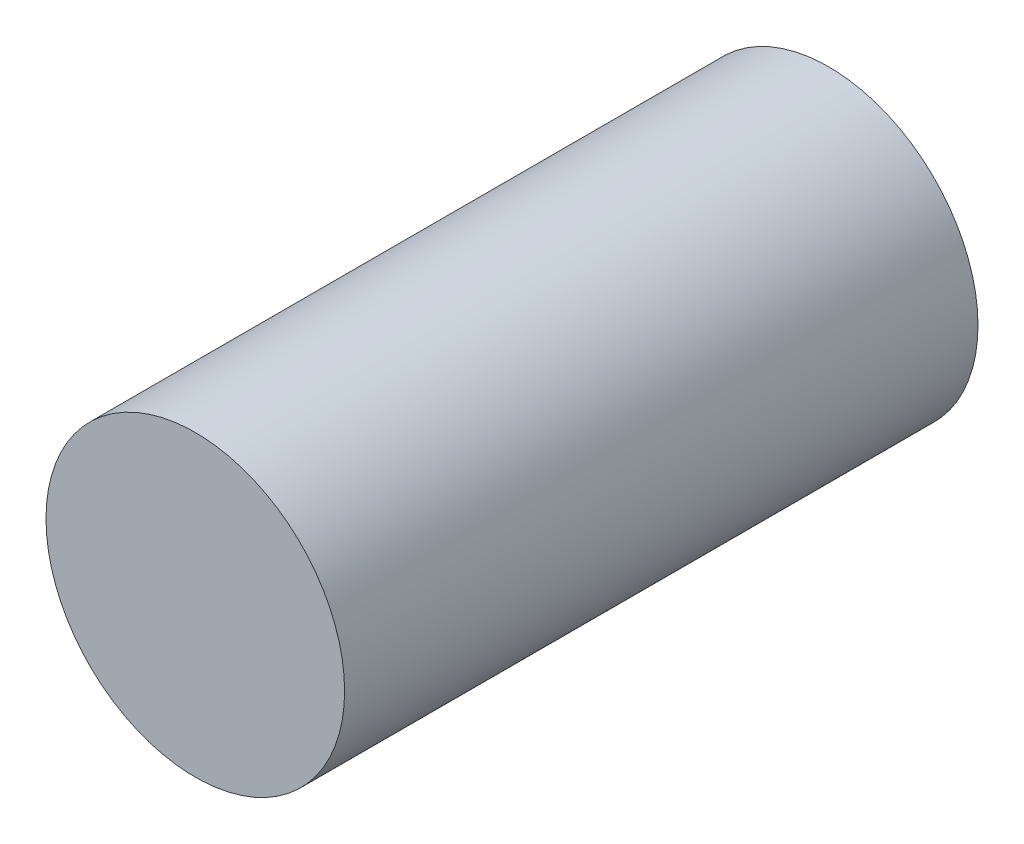
ISO-10303-21;
HEADER;
FILE_DESCRIPTION(('STEP AP214'),'2;1');
FILE_NAME('part.step','',(''),(''),'','','');
FILE_SCHEMA(('AUTOMOTIVE_DESIGN { 1 0 10303 214 1 1 1 1 }'));
ENDSEC;
DATA;
#1=APPLICATION_CONTEXT('core data for automotive mechanical design processes');
#2=APPLICATION_PROTOCOL_DEFINITION('international standard','automotive_design',2000,#1);
#3=PRODUCT_CONTEXT('',#1,'mechanical');
#4=PRODUCT('Part','Part','',(#3));
#5=PRODUCT_RELATED_PRODUCT_CATEGORY('part','',(#4));
#6=PRODUCT_DEFINITION_FORMATION('','',#4);
#7=PRODUCT_DEFINITION_CONTEXT('part definition',#1,'design');
#8=PRODUCT_DEFINITION('design','',#6,#7);
#9=PRODUCT_DEFINITION_SHAPE('','',#8);
#10=(LENGTH_UNIT() NAMED_UNIT(*) SI_UNIT(.MILLI.,.METRE.));
#11=(NAMED_UNIT(*) PLANE_ANGLE_UNIT() SI_UNIT($,.RADIAN.));
#12=(NAMED_UNIT(*) SI_UNIT($,.STERADIAN.) SOLID_ANGLE_UNIT());
#13=UNCERTAINTY_MEASURE_WITH_UNIT(LENGTH_MEASURE(1.E-05),#10,'distance_accuracy_value','');
#14=(GEOMETRIC_REPRESENTATION_CONTEXT(3) GLOBAL_UNCERTAINTY_ASSIGNED_CONTEXT((#13)) GLOBAL_UNIT_ASSIGNED_CONTEXT((#10,
#11,#12)) REPRESENTATION_CONTEXT('',''));
#15=CARTESIAN_POINT('',(0.,0.,0.));
#16=DIRECTION('',(0.,0.,1.));
#17=DIRECTION('',(1.,0.,0.));
#18=AXIS2_PLACEMENT_3D('',#15,#16,#17);
#19=CARTESIAN_POINT('',(0.,0.,70.));
#20=DIRECTION('',(0.,0.,-1.));
#21=DIRECTION('',(-1.,0.,0.));
#22=AXIS2_PLACEMENT_3D('',#19,#20,#21);
#23=CYLINDRICAL_SURFACE('',#22,16.5);
#24=CARTESIAN_POINT('',(0.,0.,70.));
#25=DIRECTION('',(0.,0.,1.));
#26=DIRECTION('',(1.,0.,0.));
#27=AXIS2_PLACEMENT_3D('',#24,#25,#26);
#28=CIRCLE('',#27,16.5);
#29=CARTESIAN_POINT('',(16.5,0.,70.));
#30=VERTEX_POINT('',#29);
#31=EDGE_CURVE('E10',#30,#30,#28,.T.);
#32=ORIENTED_EDGE('',*,*,#31,.F.);
#33=EDGE_LOOP('',(#32));
#34=FACE_BOUND('',#33,.T.);
#35=CARTESIAN_POINT('',(0.,0.,0.));
#36=DIRECTION('',(0.,0.,1.));
#37=DIRECTION('',(1.,0.,0.));
#38=AXIS2_PLACEMENT_3D('',#35,#36,#37);
#39=CIRCLE('',#38,16.5);
#40=CARTESIAN_POINT('',(16.5,0.,0.));
#41=VERTEX_POINT('',#40);
#42=EDGE_CURVE('E40',#41,#41,#39,.T.);
#43=ORIENTED_EDGE('',*,*,#42,.T.);
#44=EDGE_LOOP('',(#43));
#45=FACE_BOUND('',#44,.T.);
#46=ADVANCED_FACE('F37',(#34,#45),#23,.T.);
#47=CARTESIAN_POINT('',(0.,0.,70.));
#48=DIRECTION('',(0.,0.,1.));
#49=DIRECTION('',(1.,0.,0.));
#50=AXIS2_PLACEMENT_3D('',#47,#48,#49);
#51=PLANE('',#50);
#52=ORIENTED_EDGE('',*,*,#31,.T.);
#53=EDGE_LOOP('',(#52));
#54=FACE_BOUND('',#53,.T.);
#55=ADVANCED_FACE('F54',(#54),#51,.T.);
#56=CARTESIAN_POINT('',(0.,0.,0.));
#57=DIRECTION('',(0.,0.,1.));
#58=DIRECTION('',(1.,0.,0.));
#59=AXIS2_PLACEMENT_3D('',#56,#57,#58);
#60=PLANE('',#59);
#61=ORIENTED_EDGE('',*,*,#42,.F.);
#62=EDGE_LOOP('',(#61));
#63=FACE_BOUND('',#62,.T.);
#64=ADVANCED_FACE('F52',(#63),#60,.F.);
#65=CLOSED_SHELL('',(#46,#55,#64));
#66=MANIFOLD_SOLID_BREP('B2',#65);
#67=ADVANCED_BREP_SHAPE_REPRESENTATION('',(#18,#66),#14);
#68=SHAPE_DEFINITION_REPRESENTATION(#9,#67);
ENDSEC;
END-ISO-10303-21;
